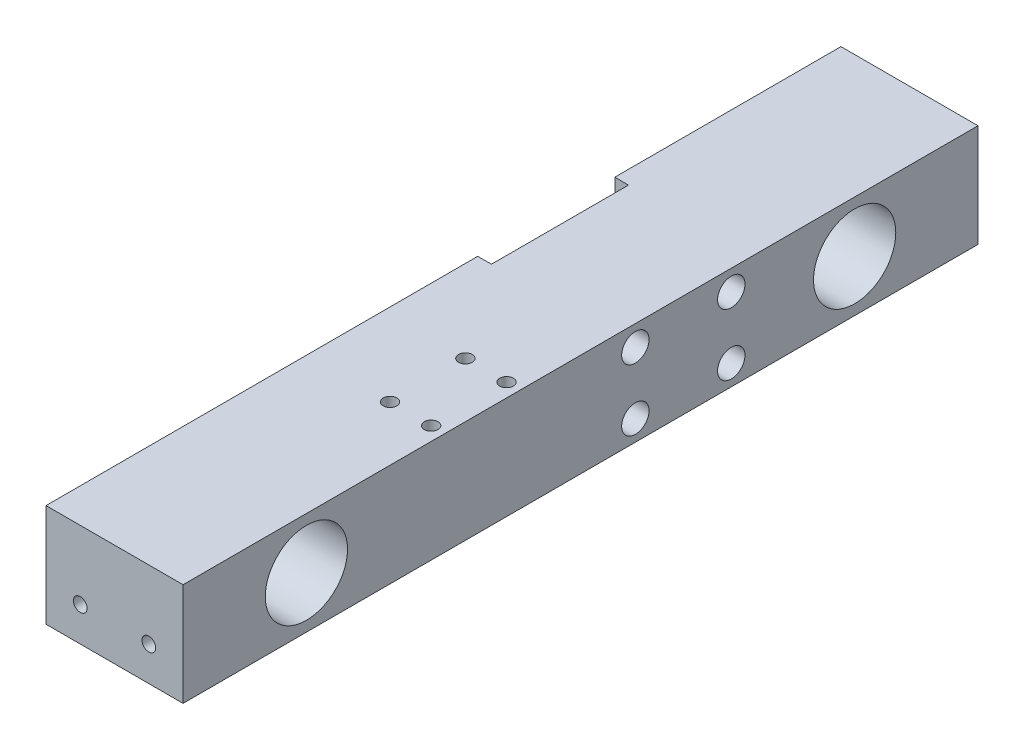
ISO-10303-21;
HEADER;
FILE_DESCRIPTION(('STEP AP214'),'2;1');
FILE_NAME('part.step','',(''),(''),'','','');
FILE_SCHEMA(('AUTOMOTIVE_DESIGN { 1 0 10303 214 1 1 1 1 }'));
ENDSEC;
DATA;
#1=APPLICATION_CONTEXT('core data for automotive mechanical design processes');
#2=APPLICATION_PROTOCOL_DEFINITION('international standard','automotive_design',2000,#1);
#3=PRODUCT_CONTEXT('',#1,'mechanical');
#4=PRODUCT('Part','Part','',(#3));
#5=PRODUCT_RELATED_PRODUCT_CATEGORY('part','',(#4));
#6=PRODUCT_DEFINITION_FORMATION('','',#4);
#7=PRODUCT_DEFINITION_CONTEXT('part definition',#1,'design');
#8=PRODUCT_DEFINITION('design','',#6,#7);
#9=PRODUCT_DEFINITION_SHAPE('','',#8);
#10=(LENGTH_UNIT() NAMED_UNIT(*) SI_UNIT(.MILLI.,.METRE.));
#11=(NAMED_UNIT(*) PLANE_ANGLE_UNIT() SI_UNIT($,.RADIAN.));
#12=(NAMED_UNIT(*) SI_UNIT($,.STERADIAN.) SOLID_ANGLE_UNIT());
#13=UNCERTAINTY_MEASURE_WITH_UNIT(LENGTH_MEASURE(1.E-05),#10,'distance_accuracy_value','');
#14=(GEOMETRIC_REPRESENTATION_CONTEXT(3) GLOBAL_UNCERTAINTY_ASSIGNED_CONTEXT((#13)) GLOBAL_UNIT_ASSIGNED_CONTEXT((#10,
#11,#12)) REPRESENTATION_CONTEXT('',''));
#15=CARTESIAN_POINT('',(0.,0.,0.));
#16=DIRECTION('',(0.,0.,1.));
#17=DIRECTION('',(1.,0.,0.));
#18=AXIS2_PLACEMENT_3D('',#15,#16,#17);
#19=CARTESIAN_POINT('',(20.,12.,36.));
#20=DIRECTION('',(-1.,0.,0.));
#21=DIRECTION('',(0.,-1.,0.));
#22=AXIS2_PLACEMENT_3D('',#19,#20,#21);
#23=CYLINDRICAL_SURFACE('',#22,0.999999999999998);
#24=CARTESIAN_POINT('',(15.,12.,36.));
#25=DIRECTION('',(1.,0.,0.));
#26=DIRECTION('',(0.,0.,-1.));
#27=AXIS2_PLACEMENT_3D('',#24,#25,#26);
#28=CIRCLE('',#27,0.999999999999998);
#29=CARTESIAN_POINT('',(15.,12.,35.));
#30=VERTEX_POINT('',#29);
#31=EDGE_CURVE('E37',#30,#30,#28,.F.);
#32=ORIENTED_EDGE('',*,*,#31,.F.);
#33=EDGE_LOOP('',(#32));
#34=FACE_BOUND('',#33,.T.);
#35=CARTESIAN_POINT('',(2.,12.,36.));
#36=DIRECTION('',(-1.,0.,0.));
#37=DIRECTION('',(0.,-1.,0.));
#38=AXIS2_PLACEMENT_3D('',#35,#36,#37);
#39=CIRCLE('',#38,0.999999999999998);
#40=CARTESIAN_POINT('',(2.,11.,36.));
#41=VERTEX_POINT('',#40);
#42=EDGE_CURVE('E289',#41,#41,#39,.T.);
#43=ORIENTED_EDGE('',*,*,#42,.T.);
#44=EDGE_LOOP('',(#43));
#45=FACE_BOUND('',#44,.T.);
#46=ADVANCED_FACE('F33',(#34,#45),#23,.F.);
#47=CARTESIAN_POINT('',(20.,12.,50.));
#48=DIRECTION('',(-1.,0.,0.));
#49=DIRECTION('',(0.,-1.,0.));
#50=AXIS2_PLACEMENT_3D('',#47,#48,#49);
#51=CYLINDRICAL_SURFACE('',#50,0.999999999999998);
#52=CARTESIAN_POINT('',(15.,12.,50.));
#53=DIRECTION('',(1.,0.,0.));
#54=DIRECTION('',(0.,0.,-1.));
#55=AXIS2_PLACEMENT_3D('',#52,#53,#54);
#56=CIRCLE('',#55,0.999999999999998);
#57=CARTESIAN_POINT('',(15.,12.,49.));
#58=VERTEX_POINT('',#57);
#59=EDGE_CURVE('E274',#58,#58,#56,.T.);
#60=ORIENTED_EDGE('',*,*,#59,.T.);
#61=EDGE_LOOP('',(#60));
#62=FACE_BOUND('',#61,.T.);
#63=CARTESIAN_POINT('',(2.,12.,50.));
#64=DIRECTION('',(-1.,0.,0.));
#65=DIRECTION('',(0.,-1.,0.));
#66=AXIS2_PLACEMENT_3D('',#63,#64,#65);
#67=CIRCLE('',#66,0.999999999999998);
#68=CARTESIAN_POINT('',(2.,11.,50.));
#69=VERTEX_POINT('',#68);
#70=EDGE_CURVE('E290',#69,#69,#67,.F.);
#71=ORIENTED_EDGE('',*,*,#70,.F.);
#72=EDGE_LOOP('',(#71));
#73=FACE_BOUND('',#72,.T.);
#74=ADVANCED_FACE('F285',(#62,#73),#51,.F.);
#75=CARTESIAN_POINT('',(20.,3.,50.));
#76=DIRECTION('',(-1.,0.,0.));
#77=DIRECTION('',(0.,-1.,0.));
#78=AXIS2_PLACEMENT_3D('',#75,#76,#77);
#79=CYLINDRICAL_SURFACE('',#78,0.999999999999998);
#80=CARTESIAN_POINT('',(15.,3.,50.));
#81=DIRECTION('',(1.,0.,0.));
#82=DIRECTION('',(0.,0.,-1.));
#83=AXIS2_PLACEMENT_3D('',#80,#81,#82);
#84=CIRCLE('',#83,0.999999999999998);
#85=CARTESIAN_POINT('',(15.,3.,49.));
#86=VERTEX_POINT('',#85);
#87=EDGE_CURVE('E272',#86,#86,#84,.F.);
#88=ORIENTED_EDGE('',*,*,#87,.F.);
#89=EDGE_LOOP('',(#88));
#90=FACE_BOUND('',#89,.T.);
#91=CARTESIAN_POINT('',(2.,3.,50.));
#92=DIRECTION('',(-1.,0.,0.));
#93=DIRECTION('',(0.,-1.,0.));
#94=AXIS2_PLACEMENT_3D('',#91,#92,#93);
#95=CIRCLE('',#94,0.999999999999998);
#96=CARTESIAN_POINT('',(2.,2.,50.));
#97=VERTEX_POINT('',#96);
#98=EDGE_CURVE('E125',#97,#97,#95,.T.);
#99=ORIENTED_EDGE('',*,*,#98,.T.);
#100=EDGE_LOOP('',(#99));
#101=FACE_BOUND('',#100,.T.);
#102=ADVANCED_FACE('F642',(#90,#101),#79,.F.);
#103=CARTESIAN_POINT('',(20.,3.,36.));
#104=DIRECTION('',(-1.,0.,0.));
#105=DIRECTION('',(0.,-1.,0.));
#106=AXIS2_PLACEMENT_3D('',#103,#104,#105);
#107=CYLINDRICAL_SURFACE('',#106,0.999999999999998);
#108=CARTESIAN_POINT('',(15.,3.,36.));
#109=DIRECTION('',(1.,0.,0.));
#110=DIRECTION('',(0.,0.,-1.));
#111=AXIS2_PLACEMENT_3D('',#108,#109,#110);
#112=CIRCLE('',#111,0.999999999999998);
#113=CARTESIAN_POINT('',(15.,3.,35.));
#114=VERTEX_POINT('',#113);
#115=EDGE_CURVE('E157',#114,#114,#112,.T.);
#116=ORIENTED_EDGE('',*,*,#115,.T.);
#117=EDGE_LOOP('',(#116));
#118=FACE_BOUND('',#117,.T.);
#119=CARTESIAN_POINT('',(2.,3.,36.));
#120=DIRECTION('',(-1.,0.,0.));
#121=DIRECTION('',(0.,-1.,0.));
#122=AXIS2_PLACEMENT_3D('',#119,#120,#121);
#123=CIRCLE('',#122,0.999999999999998);
#124=CARTESIAN_POINT('',(2.,2.,36.));
#125=VERTEX_POINT('',#124);
#126=EDGE_CURVE('E130',#125,#125,#123,.F.);
#127=ORIENTED_EDGE('',*,*,#126,.F.);
#128=EDGE_LOOP('',(#127));
#129=FACE_BOUND('',#128,.T.);
#130=ADVANCED_FACE('F651',(#118,#129),#107,.F.);
#131=CARTESIAN_POINT('',(0.,0.,116.));
#132=DIRECTION('',(-1.,0.,0.));
#133=DIRECTION('',(0.,-1.,0.));
#134=AXIS2_PLACEMENT_3D('',#131,#132,#133);
#135=PLANE('',#134);
#136=CARTESIAN_POINT('',(0.,7.50000000000002,18.));
#137=DIRECTION('',(1.,0.,0.));
#138=DIRECTION('',(0.,0.,-1.));
#139=AXIS2_PLACEMENT_3D('',#136,#137,#138);
#140=CIRCLE('',#139,6.);
#141=CARTESIAN_POINT('',(0.,7.50000000000002,12.));
#142=VERTEX_POINT('',#141);
#143=EDGE_CURVE('E206',#142,#142,#140,.F.);
#144=ORIENTED_EDGE('',*,*,#143,.F.);
#145=EDGE_LOOP('',(#144));
#146=FACE_BOUND('',#145,.T.);
#147=DIRECTION('',(0.,0.,-1.));
#148=VECTOR('',#147,1.);
#149=CARTESIAN_POINT('',(0.,0.,116.));
#150=LINE('',#149,#148);
#151=CARTESIAN_POINT('',(0.,0.,33.));
#152=VERTEX_POINT('',#151);
#153=CARTESIAN_POINT('',(0.,0.,0.));
#154=VERTEX_POINT('',#153);
#155=EDGE_CURVE('E42',#152,#154,#150,.T.);
#156=ORIENTED_EDGE('',*,*,#155,.F.);
#157=DIRECTION('',(0.,1.,0.));
#158=VECTOR('',#157,1.);
#159=CARTESIAN_POINT('',(0.,0.,33.));
#160=LINE('',#159,#158);
#161=CARTESIAN_POINT('',(0.,15.,33.));
#162=VERTEX_POINT('',#161);
#163=EDGE_CURVE('E122',#152,#162,#160,.T.);
#164=ORIENTED_EDGE('',*,*,#163,.T.);
#165=DIRECTION('',(0.,0.,-1.));
#166=VECTOR('',#165,1.);
#167=CARTESIAN_POINT('',(0.,15.,116.));
#168=LINE('',#167,#166);
#169=CARTESIAN_POINT('',(0.,15.,0.));
#170=VERTEX_POINT('',#169);
#171=EDGE_CURVE('E244',#162,#170,#168,.T.);
#172=ORIENTED_EDGE('',*,*,#171,.T.);
#173=DIRECTION('',(0.,1.,0.));
#174=VECTOR('',#173,1.);
#175=CARTESIAN_POINT('',(0.,0.,0.));
#176=LINE('',#175,#174);
#177=EDGE_CURVE('E226',#154,#170,#176,.T.);
#178=ORIENTED_EDGE('',*,*,#177,.F.);
#179=EDGE_LOOP('',(#156,#164,#172,#178));
#180=FACE_BOUND('',#179,.T.);
#181=ADVANCED_FACE('F308',(#146,#180),#135,.T.);
#182=CARTESIAN_POINT('',(0.,0.,116.));
#183=DIRECTION('',(0.,1.,0.));
#184=DIRECTION('',(0.,0.,1.));
#185=AXIS2_PLACEMENT_3D('',#182,#183,#184);
#186=PLANE('',#185);
#187=CARTESIAN_POINT('',(18.,0.,66.8));
#188=DIRECTION('',(0.,-1.,0.));
#189=DIRECTION('',(0.,0.,-1.));
#190=AXIS2_PLACEMENT_3D('',#187,#188,#189);
#191=CIRCLE('',#190,1.5);
#192=CARTESIAN_POINT('',(18.,0.,65.3));
#193=VERTEX_POINT('',#192);
#194=EDGE_CURVE('E170',#193,#193,#191,.T.);
#195=ORIENTED_EDGE('',*,*,#194,.F.);
#196=EDGE_LOOP('',(#195));
#197=FACE_BOUND('',#196,.T.);
#198=CARTESIAN_POINT('',(12.,0.,77.8));
#199=DIRECTION('',(0.,-1.,0.));
#200=DIRECTION('',(0.,0.,-1.));
#201=AXIS2_PLACEMENT_3D('',#198,#199,#200);
#202=CIRCLE('',#201,1.5);
#203=CARTESIAN_POINT('',(12.,0.,76.3));
#204=VERTEX_POINT('',#203);
#205=EDGE_CURVE('E160',#204,#204,#202,.T.);
#206=ORIENTED_EDGE('',*,*,#205,.F.);
#207=EDGE_LOOP('',(#206));
#208=FACE_BOUND('',#207,.T.);
#209=CARTESIAN_POINT('',(18.,0.,77.8));
#210=DIRECTION('',(0.,-1.,0.));
#211=DIRECTION('',(0.,0.,-1.));
#212=AXIS2_PLACEMENT_3D('',#209,#210,#211);
#213=CIRCLE('',#212,1.5);
#214=CARTESIAN_POINT('',(18.,0.,76.3));
#215=VERTEX_POINT('',#214);
#216=EDGE_CURVE('E174',#215,#215,#213,.T.);
#217=ORIENTED_EDGE('',*,*,#216,.F.);
#218=EDGE_LOOP('',(#217));
#219=FACE_BOUND('',#218,.T.);
#220=CARTESIAN_POINT('',(12.,0.,66.8));
#221=DIRECTION('',(0.,-1.,0.));
#222=DIRECTION('',(0.,0.,-1.));
#223=AXIS2_PLACEMENT_3D('',#220,#221,#222);
#224=CIRCLE('',#223,1.5);
#225=CARTESIAN_POINT('',(12.,0.,65.3));
#226=VERTEX_POINT('',#225);
#227=EDGE_CURVE('E167',#226,#226,#224,.T.);
#228=ORIENTED_EDGE('',*,*,#227,.F.);
#229=EDGE_LOOP('',(#228));
#230=FACE_BOUND('',#229,.T.);
#231=DIRECTION('',(-1.,0.,0.));
#232=VECTOR('',#231,1.);
#233=CARTESIAN_POINT('',(2.,0.,33.));
#234=LINE('',#233,#232);
#235=CARTESIAN_POINT('',(2.,0.,33.));
#236=VERTEX_POINT('',#235);
#237=EDGE_CURVE('E153',#236,#152,#234,.T.);
#238=ORIENTED_EDGE('',*,*,#237,.T.);
#239=ORIENTED_EDGE('',*,*,#155,.T.);
#240=DIRECTION('',(1.,0.,0.));
#241=VECTOR('',#240,1.);
#242=CARTESIAN_POINT('',(0.,0.,0.));
#243=LINE('',#242,#241);
#244=CARTESIAN_POINT('',(20.,0.,0.));
#245=VERTEX_POINT('',#244);
#246=EDGE_CURVE('E238',#154,#245,#243,.T.);
#247=ORIENTED_EDGE('',*,*,#246,.T.);
#248=DIRECTION('',(0.,0.,-1.));
#249=VECTOR('',#248,1.);
#250=CARTESIAN_POINT('',(20.,0.,116.));
#251=LINE('',#250,#249);
#252=CARTESIAN_POINT('',(20.,0.,116.));
#253=VERTEX_POINT('',#252);
#254=EDGE_CURVE('E254',#253,#245,#251,.T.);
#255=ORIENTED_EDGE('',*,*,#254,.F.);
#256=DIRECTION('',(1.,0.,0.));
#257=VECTOR('',#256,1.);
#258=CARTESIAN_POINT('',(0.,0.,116.));
#259=LINE('',#258,#257);
#260=CARTESIAN_POINT('',(0.,0.,116.));
#261=VERTEX_POINT('',#260);
#262=EDGE_CURVE('E242',#261,#253,#259,.T.);
#263=ORIENTED_EDGE('',*,*,#262,.F.);
#264=CARTESIAN_POINT('',(0.,0.,53.));
#265=VERTEX_POINT('',#264);
#266=EDGE_CURVE('E11',#261,#265,#150,.T.);
#267=ORIENTED_EDGE('',*,*,#266,.T.);
#268=DIRECTION('',(-1.,0.,0.));
#269=VECTOR('',#268,1.);
#270=CARTESIAN_POINT('',(2.,0.,53.));
#271=LINE('',#270,#269);
#272=CARTESIAN_POINT('',(2.,0.,53.));
#273=VERTEX_POINT('',#272);
#274=EDGE_CURVE('E111',#273,#265,#271,.T.);
#275=ORIENTED_EDGE('',*,*,#274,.F.);
#276=DIRECTION('',(0.,0.,1.));
#277=VECTOR('',#276,1.);
#278=CARTESIAN_POINT('',(2.,0.,0.));
#279=LINE('',#278,#277);
#280=EDGE_CURVE('E115',#236,#273,#279,.T.);
#281=ORIENTED_EDGE('',*,*,#280,.F.);
#282=EDGE_LOOP('',(#238,#239,#247,#255,#263,#267,#275,#281));
#283=FACE_BOUND('',#282,.T.);
#284=ADVANCED_FACE('F124',(#197,#208,#219,#230,#283),#186,.F.);
#285=CARTESIAN_POINT('',(0.,15.,116.));
#286=DIRECTION('',(0.,1.,0.));
#287=DIRECTION('',(-1.,0.,0.));
#288=AXIS2_PLACEMENT_3D('',#285,#286,#287);
#289=PLANE('',#288);
#290=CARTESIAN_POINT('',(12.,15.,77.8));
#291=DIRECTION('',(0.,-1.,0.));
#292=DIRECTION('',(1.,0.,0.));
#293=AXIS2_PLACEMENT_3D('',#290,#291,#292);
#294=CIRCLE('',#293,1.);
#295=CARTESIAN_POINT('',(13.,15.,77.8));
#296=VERTEX_POINT('',#295);
#297=EDGE_CURVE('E185',#296,#296,#294,.T.);
#298=ORIENTED_EDGE('',*,*,#297,.T.);
#299=EDGE_LOOP('',(#298));
#300=FACE_BOUND('',#299,.T.);
#301=CARTESIAN_POINT('',(12.,15.,66.8));
#302=DIRECTION('',(0.,1.,0.));
#303=DIRECTION('',(-1.,0.,0.));
#304=AXIS2_PLACEMENT_3D('',#301,#302,#303);
#305=CIRCLE('',#304,1.);
#306=CARTESIAN_POINT('',(11.,15.,66.8));
#307=VERTEX_POINT('',#306);
#308=EDGE_CURVE('E188',#307,#307,#305,.T.);
#309=ORIENTED_EDGE('',*,*,#308,.F.);
#310=EDGE_LOOP('',(#309));
#311=FACE_BOUND('',#310,.T.);
#312=CARTESIAN_POINT('',(18.,15.,77.8));
#313=DIRECTION('',(0.,1.,0.));
#314=DIRECTION('',(-1.,0.,0.));
#315=AXIS2_PLACEMENT_3D('',#312,#313,#314);
#316=CIRCLE('',#315,1.);
#317=CARTESIAN_POINT('',(17.,15.,77.8));
#318=VERTEX_POINT('',#317);
#319=EDGE_CURVE('E189',#318,#318,#316,.T.);
#320=ORIENTED_EDGE('',*,*,#319,.F.);
#321=EDGE_LOOP('',(#320));
#322=FACE_BOUND('',#321,.T.);
#323=CARTESIAN_POINT('',(18.,15.,66.8));
#324=DIRECTION('',(0.,-1.,0.));
#325=DIRECTION('',(1.,0.,0.));
#326=AXIS2_PLACEMENT_3D('',#323,#324,#325);
#327=CIRCLE('',#326,1.);
#328=CARTESIAN_POINT('',(19.,15.,66.8));
#329=VERTEX_POINT('',#328);
#330=EDGE_CURVE('E192',#329,#329,#327,.T.);
#331=ORIENTED_EDGE('',*,*,#330,.T.);
#332=EDGE_LOOP('',(#331));
#333=FACE_BOUND('',#332,.T.);
#334=ORIENTED_EDGE('',*,*,#171,.F.);
#335=DIRECTION('',(-1.,0.,0.));
#336=VECTOR('',#335,1.);
#337=CARTESIAN_POINT('',(2.,15.,33.));
#338=LINE('',#337,#336);
#339=CARTESIAN_POINT('',(2.,15.,33.));
#340=VERTEX_POINT('',#339);
#341=EDGE_CURVE('E127',#340,#162,#338,.T.);
#342=ORIENTED_EDGE('',*,*,#341,.F.);
#343=DIRECTION('',(0.,0.,1.));
#344=VECTOR('',#343,1.);
#345=CARTESIAN_POINT('',(2.,15.,0.));
#346=LINE('',#345,#344);
#347=CARTESIAN_POINT('',(2.,15.,53.));
#348=VERTEX_POINT('',#347);
#349=EDGE_CURVE('E114',#340,#348,#346,.T.);
#350=ORIENTED_EDGE('',*,*,#349,.T.);
#351=DIRECTION('',(-1.,0.,0.));
#352=VECTOR('',#351,1.);
#353=CARTESIAN_POINT('',(2.,15.,53.));
#354=LINE('',#353,#352);
#355=CARTESIAN_POINT('',(0.,15.,53.));
#356=VERTEX_POINT('',#355);
#357=EDGE_CURVE('E112',#348,#356,#354,.T.);
#358=ORIENTED_EDGE('',*,*,#357,.T.);
#359=CARTESIAN_POINT('',(0.,15.,116.));
#360=VERTEX_POINT('',#359);
#361=EDGE_CURVE('E86',#360,#356,#168,.T.);
#362=ORIENTED_EDGE('',*,*,#361,.F.);
#363=DIRECTION('',(1.,0.,0.));
#364=VECTOR('',#363,1.);
#365=CARTESIAN_POINT('',(0.,15.,116.));
#366=LINE('',#365,#364);
#367=CARTESIAN_POINT('',(20.,15.,116.));
#368=VERTEX_POINT('',#367);
#369=EDGE_CURVE('E237',#360,#368,#366,.T.);
#370=ORIENTED_EDGE('',*,*,#369,.T.);
#371=DIRECTION('',(0.,0.,-1.));
#372=VECTOR('',#371,1.);
#373=CARTESIAN_POINT('',(20.,15.,116.));
#374=LINE('',#373,#372);
#375=CARTESIAN_POINT('',(20.,15.,0.));
#376=VERTEX_POINT('',#375);
#377=EDGE_CURVE('E257',#368,#376,#374,.T.);
#378=ORIENTED_EDGE('',*,*,#377,.T.);
#379=DIRECTION('',(1.,0.,0.));
#380=VECTOR('',#379,1.);
#381=CARTESIAN_POINT('',(0.,15.,0.));
#382=LINE('',#381,#380);
#383=EDGE_CURVE('E247',#170,#376,#382,.T.);
#384=ORIENTED_EDGE('',*,*,#383,.F.);
#385=EDGE_LOOP('',(#334,#342,#350,#358,#362,#370,#378,#384));
#386=FACE_BOUND('',#385,.T.);
#387=ADVANCED_FACE('F311',(#300,#311,#322,#333,#386),#289,.T.);
#388=DIRECTION('',(0.,1.,0.));
#389=VECTOR('',#388,1.);
#390=CARTESIAN_POINT('',(0.,0.,53.));
#391=LINE('',#390,#389);
#392=EDGE_CURVE('E299',#265,#356,#391,.T.);
#393=ORIENTED_EDGE('',*,*,#392,.F.);
#394=ORIENTED_EDGE('',*,*,#266,.F.);
#395=DIRECTION('',(0.,1.,0.));
#396=VECTOR('',#395,1.);
#397=CARTESIAN_POINT('',(0.,0.,116.));
#398=LINE('',#397,#396);
#399=EDGE_CURVE('E235',#261,#360,#398,.T.);
#400=ORIENTED_EDGE('',*,*,#399,.T.);
#401=ORIENTED_EDGE('',*,*,#361,.T.);
#402=EDGE_LOOP('',(#393,#394,#400,#401));
#403=FACE_BOUND('',#402,.T.);
#404=CARTESIAN_POINT('',(0.,7.50000000000001,98.));
#405=DIRECTION('',(1.,0.,0.));
#406=DIRECTION('',(0.,0.,-1.));
#407=AXIS2_PLACEMENT_3D('',#404,#405,#406);
#408=CIRCLE('',#407,6.);
#409=CARTESIAN_POINT('',(0.,7.50000000000001,92.));
#410=VERTEX_POINT('',#409);
#411=EDGE_CURVE('E199',#410,#410,#408,.T.);
#412=ORIENTED_EDGE('',*,*,#411,.T.);
#413=EDGE_LOOP('',(#412));
#414=FACE_BOUND('',#413,.T.);
#415=ADVANCED_FACE('F35',(#403,#414),#135,.T.);
#416=CARTESIAN_POINT('',(20.,0.,116.));
#417=DIRECTION('',(-1.,0.,0.));
#418=DIRECTION('',(0.,0.,1.));
#419=AXIS2_PLACEMENT_3D('',#416,#417,#418);
#420=PLANE('',#419);
#421=CARTESIAN_POINT('',(20.,12.,50.));
#422=DIRECTION('',(1.,0.,0.));
#423=DIRECTION('',(0.,0.,-1.));
#424=AXIS2_PLACEMENT_3D('',#421,#422,#423);
#425=CIRCLE('',#424,2.);
#426=CARTESIAN_POINT('',(20.,12.,48.));
#427=VERTEX_POINT('',#426);
#428=EDGE_CURVE('E150',#427,#427,#425,.T.);
#429=ORIENTED_EDGE('',*,*,#428,.F.);
#430=EDGE_LOOP('',(#429));
#431=FACE_BOUND('',#430,.T.);
#432=CARTESIAN_POINT('',(20.,3.,50.));
#433=DIRECTION('',(1.,0.,0.));
#434=DIRECTION('',(0.,0.,-1.));
#435=AXIS2_PLACEMENT_3D('',#432,#433,#434);
#436=CIRCLE('',#435,2.);
#437=CARTESIAN_POINT('',(20.,3.,48.));
#438=VERTEX_POINT('',#437);
#439=EDGE_CURVE('E144',#438,#438,#436,.T.);
#440=ORIENTED_EDGE('',*,*,#439,.F.);
#441=EDGE_LOOP('',(#440));
#442=FACE_BOUND('',#441,.T.);
#443=CARTESIAN_POINT('',(20.,3.,36.));
#444=DIRECTION('',(1.,0.,0.));
#445=DIRECTION('',(0.,0.,-1.));
#446=AXIS2_PLACEMENT_3D('',#443,#444,#445);
#447=CIRCLE('',#446,2.);
#448=CARTESIAN_POINT('',(20.,3.,34.));
#449=VERTEX_POINT('',#448);
#450=EDGE_CURVE('E138',#449,#449,#447,.T.);
#451=ORIENTED_EDGE('',*,*,#450,.F.);
#452=EDGE_LOOP('',(#451));
#453=FACE_BOUND('',#452,.T.);
#454=CARTESIAN_POINT('',(20.,12.,36.));
#455=DIRECTION('',(1.,0.,0.));
#456=DIRECTION('',(0.,0.,-1.));
#457=AXIS2_PLACEMENT_3D('',#454,#455,#456);
#458=CIRCLE('',#457,2.);
#459=CARTESIAN_POINT('',(20.,12.,34.));
#460=VERTEX_POINT('',#459);
#461=EDGE_CURVE('E137',#460,#460,#458,.T.);
#462=ORIENTED_EDGE('',*,*,#461,.F.);
#463=EDGE_LOOP('',(#462));
#464=FACE_BOUND('',#463,.T.);
#465=DIRECTION('',(0.,1.,0.));
#466=VECTOR('',#465,1.);
#467=CARTESIAN_POINT('',(20.,0.,0.));
#468=LINE('',#467,#466);
#469=EDGE_CURVE('E250',#245,#376,#468,.T.);
#470=ORIENTED_EDGE('',*,*,#469,.T.);
#471=ORIENTED_EDGE('',*,*,#377,.F.);
#472=DIRECTION('',(0.,1.,0.));
#473=VECTOR('',#472,1.);
#474=CARTESIAN_POINT('',(20.,0.,116.));
#475=LINE('',#474,#473);
#476=EDGE_CURVE('E240',#253,#368,#475,.T.);
#477=ORIENTED_EDGE('',*,*,#476,.F.);
#478=ORIENTED_EDGE('',*,*,#254,.T.);
#479=EDGE_LOOP('',(#470,#471,#477,#478));
#480=FACE_BOUND('',#479,.T.);
#481=CARTESIAN_POINT('',(20.,7.50000000000002,18.));
#482=DIRECTION('',(1.,0.,0.));
#483=DIRECTION('',(0.,0.,-1.));
#484=AXIS2_PLACEMENT_3D('',#481,#482,#483);
#485=CIRCLE('',#484,6.);
#486=CARTESIAN_POINT('',(20.,7.50000000000002,12.));
#487=VERTEX_POINT('',#486);
#488=EDGE_CURVE('E198',#487,#487,#485,.F.);
#489=ORIENTED_EDGE('',*,*,#488,.T.);
#490=EDGE_LOOP('',(#489));
#491=FACE_BOUND('',#490,.T.);
#492=CARTESIAN_POINT('',(20.,7.50000000000001,98.));
#493=DIRECTION('',(1.,0.,0.));
#494=DIRECTION('',(0.,0.,-1.));
#495=AXIS2_PLACEMENT_3D('',#492,#493,#494);
#496=CIRCLE('',#495,6.);
#497=CARTESIAN_POINT('',(20.,7.50000000000001,92.));
#498=VERTEX_POINT('',#497);
#499=EDGE_CURVE('E203',#498,#498,#496,.T.);
#500=ORIENTED_EDGE('',*,*,#499,.F.);
#501=EDGE_LOOP('',(#500));
#502=FACE_BOUND('',#501,.T.);
#503=ADVANCED_FACE('F320',(#431,#442,#453,#464,#480,#491,#502),#420,.F.);
#504=CARTESIAN_POINT('',(12.,0.,66.8));
#505=DIRECTION('',(0.,1.,0.));
#506=DIRECTION('',(-1.,0.,0.));
#507=AXIS2_PLACEMENT_3D('',#504,#505,#506);
#508=CYLINDRICAL_SURFACE('',#507,1.);
#509=ORIENTED_EDGE('',*,*,#308,.T.);
#510=EDGE_LOOP('',(#509));
#511=FACE_BOUND('',#510,.T.);
#512=CARTESIAN_POINT('',(12.,5.,66.8));
#513=DIRECTION('',(0.,-1.,0.));
#514=DIRECTION('',(0.,0.,-1.));
#515=AXIS2_PLACEMENT_3D('',#512,#513,#514);
#516=CIRCLE('',#515,1.);
#517=CARTESIAN_POINT('',(12.,5.,65.8));
#518=VERTEX_POINT('',#517);
#519=EDGE_CURVE('E195',#518,#518,#516,.F.);
#520=ORIENTED_EDGE('',*,*,#519,.F.);
#521=EDGE_LOOP('',(#520));
#522=FACE_BOUND('',#521,.T.);
#523=ADVANCED_FACE('F339',(#511,#522),#508,.F.);
#524=CARTESIAN_POINT('',(12.,0.,77.8));
#525=DIRECTION('',(0.,1.,0.));
#526=DIRECTION('',(-1.,0.,0.));
#527=AXIS2_PLACEMENT_3D('',#524,#525,#526);
#528=CYLINDRICAL_SURFACE('',#527,1.);
#529=ORIENTED_EDGE('',*,*,#297,.F.);
#530=EDGE_LOOP('',(#529));
#531=FACE_BOUND('',#530,.T.);
#532=CARTESIAN_POINT('',(12.,5.,77.8));
#533=DIRECTION('',(0.,-1.,0.));
#534=DIRECTION('',(0.,0.,-1.));
#535=AXIS2_PLACEMENT_3D('',#532,#533,#534);
#536=CIRCLE('',#535,1.);
#537=CARTESIAN_POINT('',(12.,5.,76.8));
#538=VERTEX_POINT('',#537);
#539=EDGE_CURVE('E265',#538,#538,#536,.T.);
#540=ORIENTED_EDGE('',*,*,#539,.T.);
#541=EDGE_LOOP('',(#540));
#542=FACE_BOUND('',#541,.T.);
#543=ADVANCED_FACE('F345',(#531,#542),#528,.F.);
#544=CARTESIAN_POINT('',(18.,0.,77.8));
#545=DIRECTION('',(0.,1.,0.));
#546=DIRECTION('',(-1.,0.,0.));
#547=AXIS2_PLACEMENT_3D('',#544,#545,#546);
#548=CYLINDRICAL_SURFACE('',#547,1.);
#549=ORIENTED_EDGE('',*,*,#319,.T.);
#550=EDGE_LOOP('',(#549));
#551=FACE_BOUND('',#550,.T.);
#552=CARTESIAN_POINT('',(18.,5.,77.8));
#553=DIRECTION('',(0.,-1.,0.));
#554=DIRECTION('',(0.,0.,-1.));
#555=AXIS2_PLACEMENT_3D('',#552,#553,#554);
#556=CIRCLE('',#555,1.);
#557=CARTESIAN_POINT('',(18.,5.,76.8));
#558=VERTEX_POINT('',#557);
#559=EDGE_CURVE('E262',#558,#558,#556,.F.);
#560=ORIENTED_EDGE('',*,*,#559,.F.);
#561=EDGE_LOOP('',(#560));
#562=FACE_BOUND('',#561,.T.);
#563=ADVANCED_FACE('F369',(#551,#562),#548,.F.);
#564=CARTESIAN_POINT('',(18.,0.,66.8));
#565=DIRECTION('',(0.,1.,0.));
#566=DIRECTION('',(-1.,0.,0.));
#567=AXIS2_PLACEMENT_3D('',#564,#565,#566);
#568=CYLINDRICAL_SURFACE('',#567,1.);
#569=ORIENTED_EDGE('',*,*,#330,.F.);
#570=EDGE_LOOP('',(#569));
#571=FACE_BOUND('',#570,.T.);
#572=CARTESIAN_POINT('',(18.,5.,66.8));
#573=DIRECTION('',(0.,-1.,0.));
#574=DIRECTION('',(0.,0.,-1.));
#575=AXIS2_PLACEMENT_3D('',#572,#573,#574);
#576=CIRCLE('',#575,1.);
#577=CARTESIAN_POINT('',(18.,5.,65.8));
#578=VERTEX_POINT('',#577);
#579=EDGE_CURVE('E182',#578,#578,#576,.T.);
#580=ORIENTED_EDGE('',*,*,#579,.T.);
#581=EDGE_LOOP('',(#580));
#582=FACE_BOUND('',#581,.T.);
#583=ADVANCED_FACE('F366',(#571,#582),#568,.F.);
#584=CARTESIAN_POINT('',(0.,0.,116.));
#585=DIRECTION('',(0.,0.,-1.));
#586=DIRECTION('',(-1.,0.,0.));
#587=AXIS2_PLACEMENT_3D('',#584,#585,#586);
#588=PLANE('',#587);
#589=CARTESIAN_POINT('',(5.,5.00000000000001,116.));
#590=DIRECTION('',(0.,0.,1.));
#591=DIRECTION('',(1.,0.,0.));
#592=AXIS2_PLACEMENT_3D('',#589,#590,#591);
#593=CIRCLE('',#592,1.);
#594=CARTESIAN_POINT('',(6.,5.00000000000001,116.));
#595=VERTEX_POINT('',#594);
#596=EDGE_CURVE('E218',#595,#595,#593,.T.);
#597=ORIENTED_EDGE('',*,*,#596,.F.);
#598=EDGE_LOOP('',(#597));
#599=FACE_BOUND('',#598,.T.);
#600=ORIENTED_EDGE('',*,*,#399,.F.);
#601=ORIENTED_EDGE('',*,*,#262,.T.);
#602=ORIENTED_EDGE('',*,*,#476,.T.);
#603=ORIENTED_EDGE('',*,*,#369,.F.);
#604=EDGE_LOOP('',(#600,#601,#602,#603));
#605=FACE_BOUND('',#604,.T.);
#606=CARTESIAN_POINT('',(15.,5.00000000000001,116.));
#607=DIRECTION('',(0.,0.,-1.));
#608=DIRECTION('',(-1.,0.,0.));
#609=AXIS2_PLACEMENT_3D('',#606,#607,#608);
#610=CIRCLE('',#609,1.);
#611=CARTESIAN_POINT('',(14.,5.00000000000001,116.));
#612=VERTEX_POINT('',#611);
#613=EDGE_CURVE('E215',#612,#612,#610,.T.);
#614=ORIENTED_EDGE('',*,*,#613,.T.);
#615=EDGE_LOOP('',(#614));
#616=FACE_BOUND('',#615,.T.);
#617=ADVANCED_FACE('F324',(#599,#605,#616),#588,.F.);
#618=CARTESIAN_POINT('',(0.,0.,0.));
#619=DIRECTION('',(0.,0.,-1.));
#620=DIRECTION('',(-1.,0.,0.));
#621=AXIS2_PLACEMENT_3D('',#618,#619,#620);
#622=PLANE('',#621);
#623=ORIENTED_EDGE('',*,*,#177,.T.);
#624=ORIENTED_EDGE('',*,*,#383,.T.);
#625=ORIENTED_EDGE('',*,*,#469,.F.);
#626=ORIENTED_EDGE('',*,*,#246,.F.);
#627=EDGE_LOOP('',(#623,#624,#625,#626));
#628=FACE_BOUND('',#627,.T.);
#629=CARTESIAN_POINT('',(5.,5.00000000000001,0.));
#630=DIRECTION('',(0.,0.,-1.));
#631=DIRECTION('',(-1.,0.,0.));
#632=AXIS2_PLACEMENT_3D('',#629,#630,#631);
#633=CIRCLE('',#632,1.);
#634=CARTESIAN_POINT('',(4.,5.00000000000001,0.));
#635=VERTEX_POINT('',#634);
#636=EDGE_CURVE('E230',#635,#635,#633,.T.);
#637=ORIENTED_EDGE('',*,*,#636,.F.);
#638=EDGE_LOOP('',(#637));
#639=FACE_BOUND('',#638,.T.);
#640=CARTESIAN_POINT('',(15.,5.00000000000001,0.));
#641=DIRECTION('',(0.,0.,1.));
#642=DIRECTION('',(1.,0.,0.));
#643=AXIS2_PLACEMENT_3D('',#640,#641,#642);
#644=CIRCLE('',#643,1.);
#645=CARTESIAN_POINT('',(16.,5.00000000000001,0.));
#646=VERTEX_POINT('',#645);
#647=EDGE_CURVE('E227',#646,#646,#644,.T.);
#648=ORIENTED_EDGE('',*,*,#647,.T.);
#649=EDGE_LOOP('',(#648));
#650=FACE_BOUND('',#649,.T.);
#651=ADVANCED_FACE('F315',(#628,#639,#650),#622,.T.);
#652=CARTESIAN_POINT('',(5.,5.00000000000001,10.));
#653=DIRECTION('',(0.,0.,-1.));
#654=DIRECTION('',(-1.,0.,0.));
#655=AXIS2_PLACEMENT_3D('',#652,#653,#654);
#656=CYLINDRICAL_SURFACE('',#655,1.);
#657=CARTESIAN_POINT('',(5.,5.00000000000001,10.));
#658=DIRECTION('',(0.,0.,-1.));
#659=DIRECTION('',(-1.,0.,0.));
#660=AXIS2_PLACEMENT_3D('',#657,#658,#659);
#661=CIRCLE('',#660,1.);
#662=CARTESIAN_POINT('',(4.,5.00000000000001,10.));
#663=VERTEX_POINT('',#662);
#664=EDGE_CURVE('E214',#663,#663,#661,.T.);
#665=ORIENTED_EDGE('',*,*,#664,.F.);
#666=EDGE_LOOP('',(#665));
#667=FACE_BOUND('',#666,.T.);
#668=ORIENTED_EDGE('',*,*,#636,.T.);
#669=EDGE_LOOP('',(#668));
#670=FACE_BOUND('',#669,.T.);
#671=ADVANCED_FACE('F453',(#667,#670),#656,.F.);
#672=CARTESIAN_POINT('',(5.,5.00000000000001,10.));
#673=DIRECTION('',(0.,0.,-1.));
#674=DIRECTION('',(-1.,0.,0.));
#675=AXIS2_PLACEMENT_3D('',#672,#673,#674);
#676=PLANE('',#675);
#677=ORIENTED_EDGE('',*,*,#664,.T.);
#678=EDGE_LOOP('',(#677));
#679=FACE_BOUND('',#678,.T.);
#680=ADVANCED_FACE('F451',(#679),#676,.T.);
#681=CARTESIAN_POINT('',(15.,5.00000000000001,10.));
#682=DIRECTION('',(0.,0.,-1.));
#683=DIRECTION('',(-1.,0.,0.));
#684=AXIS2_PLACEMENT_3D('',#681,#682,#683);
#685=CYLINDRICAL_SURFACE('',#684,1.);
#686=CARTESIAN_POINT('',(15.,5.00000000000001,10.));
#687=DIRECTION('',(0.,0.,1.));
#688=DIRECTION('',(1.,0.,0.));
#689=AXIS2_PLACEMENT_3D('',#686,#687,#688);
#690=CIRCLE('',#689,1.);
#691=CARTESIAN_POINT('',(16.,5.00000000000001,10.));
#692=VERTEX_POINT('',#691);
#693=EDGE_CURVE('E223',#692,#692,#690,.T.);
#694=ORIENTED_EDGE('',*,*,#693,.T.);
#695=EDGE_LOOP('',(#694));
#696=FACE_BOUND('',#695,.T.);
#697=ORIENTED_EDGE('',*,*,#647,.F.);
#698=EDGE_LOOP('',(#697));
#699=FACE_BOUND('',#698,.T.);
#700=ADVANCED_FACE('F447',(#696,#699),#685,.F.);
#701=CARTESIAN_POINT('',(15.,5.00000000000001,10.));
#702=DIRECTION('',(0.,0.,1.));
#703=DIRECTION('',(1.,0.,0.));
#704=AXIS2_PLACEMENT_3D('',#701,#702,#703);
#705=PLANE('',#704);
#706=ORIENTED_EDGE('',*,*,#693,.F.);
#707=EDGE_LOOP('',(#706));
#708=FACE_BOUND('',#707,.T.);
#709=ADVANCED_FACE('F440',(#708),#705,.F.);
#710=CARTESIAN_POINT('',(5.,5.00000000000001,106.));
#711=DIRECTION('',(0.,0.,1.));
#712=DIRECTION('',(1.,0.,0.));
#713=AXIS2_PLACEMENT_3D('',#710,#711,#712);
#714=CYLINDRICAL_SURFACE('',#713,1.);
#715=CARTESIAN_POINT('',(5.,5.00000000000001,106.));
#716=DIRECTION('',(0.,0.,1.));
#717=DIRECTION('',(1.,0.,0.));
#718=AXIS2_PLACEMENT_3D('',#715,#716,#717);
#719=CIRCLE('',#718,1.);
#720=CARTESIAN_POINT('',(6.,5.00000000000001,106.));
#721=VERTEX_POINT('',#720);
#722=EDGE_CURVE('E202',#721,#721,#719,.T.);
#723=ORIENTED_EDGE('',*,*,#722,.F.);
#724=EDGE_LOOP('',(#723));
#725=FACE_BOUND('',#724,.T.);
#726=ORIENTED_EDGE('',*,*,#596,.T.);
#727=EDGE_LOOP('',(#726));
#728=FACE_BOUND('',#727,.T.);
#729=ADVANCED_FACE('F437',(#725,#728),#714,.F.);
#730=CARTESIAN_POINT('',(5.,5.00000000000001,106.));
#731=DIRECTION('',(0.,0.,1.));
#732=DIRECTION('',(1.,0.,0.));
#733=AXIS2_PLACEMENT_3D('',#730,#731,#732);
#734=PLANE('',#733);
#735=ORIENTED_EDGE('',*,*,#722,.T.);
#736=EDGE_LOOP('',(#735));
#737=FACE_BOUND('',#736,.T.);
#738=ADVANCED_FACE('F435',(#737),#734,.T.);
#739=CARTESIAN_POINT('',(15.,5.00000000000001,106.));
#740=DIRECTION('',(0.,0.,1.));
#741=DIRECTION('',(1.,0.,0.));
#742=AXIS2_PLACEMENT_3D('',#739,#740,#741);
#743=CYLINDRICAL_SURFACE('',#742,1.);
#744=CARTESIAN_POINT('',(15.,5.00000000000001,106.));
#745=DIRECTION('',(0.,0.,-1.));
#746=DIRECTION('',(-1.,0.,0.));
#747=AXIS2_PLACEMENT_3D('',#744,#745,#746);
#748=CIRCLE('',#747,1.);
#749=CARTESIAN_POINT('',(14.,5.00000000000001,106.));
#750=VERTEX_POINT('',#749);
#751=EDGE_CURVE('E211',#750,#750,#748,.T.);
#752=ORIENTED_EDGE('',*,*,#751,.T.);
#753=EDGE_LOOP('',(#752));
#754=FACE_BOUND('',#753,.T.);
#755=ORIENTED_EDGE('',*,*,#613,.F.);
#756=EDGE_LOOP('',(#755));
#757=FACE_BOUND('',#756,.T.);
#758=ADVANCED_FACE('F431',(#754,#757),#743,.F.);
#759=CARTESIAN_POINT('',(15.,5.00000000000001,106.));
#760=DIRECTION('',(0.,0.,-1.));
#761=DIRECTION('',(-1.,0.,0.));
#762=AXIS2_PLACEMENT_3D('',#759,#760,#761);
#763=PLANE('',#762);
#764=ORIENTED_EDGE('',*,*,#751,.F.);
#765=EDGE_LOOP('',(#764));
#766=FACE_BOUND('',#765,.T.);
#767=ADVANCED_FACE('F427',(#766),#763,.F.);
#768=CARTESIAN_POINT('',(0.,7.50000000000002,18.));
#769=DIRECTION('',(1.,0.,0.));
#770=DIRECTION('',(0.,0.,-1.));
#771=AXIS2_PLACEMENT_3D('',#768,#769,#770);
#772=CYLINDRICAL_SURFACE('',#771,6.);
#773=ORIENTED_EDGE('',*,*,#143,.T.);
#774=EDGE_LOOP('',(#773));
#775=FACE_BOUND('',#774,.T.);
#776=ORIENTED_EDGE('',*,*,#488,.F.);
#777=EDGE_LOOP('',(#776));
#778=FACE_BOUND('',#777,.T.);
#779=ADVANCED_FACE('F334',(#775,#778),#772,.F.);
#780=CARTESIAN_POINT('',(0.,7.50000000000001,98.));
#781=DIRECTION('',(1.,0.,0.));
#782=DIRECTION('',(0.,0.,-1.));
#783=AXIS2_PLACEMENT_3D('',#780,#781,#782);
#784=CYLINDRICAL_SURFACE('',#783,6.);
#785=ORIENTED_EDGE('',*,*,#411,.F.);
#786=EDGE_LOOP('',(#785));
#787=FACE_BOUND('',#786,.T.);
#788=ORIENTED_EDGE('',*,*,#499,.T.);
#789=EDGE_LOOP('',(#788));
#790=FACE_BOUND('',#789,.T.);
#791=ADVANCED_FACE('F330',(#787,#790),#784,.F.);
#792=CARTESIAN_POINT('',(18.,5.,66.8));
#793=DIRECTION('',(0.,-1.,0.));
#794=DIRECTION('',(0.,0.,-1.));
#795=AXIS2_PLACEMENT_3D('',#792,#793,#794);
#796=CYLINDRICAL_SURFACE('',#795,1.5);
#797=CARTESIAN_POINT('',(18.,5.,66.8));
#798=DIRECTION('',(0.,-1.,0.));
#799=DIRECTION('',(0.,0.,-1.));
#800=AXIS2_PLACEMENT_3D('',#797,#798,#799);
#801=CIRCLE('',#800,1.5);
#802=CARTESIAN_POINT('',(18.,5.,65.3));
#803=VERTEX_POINT('',#802);
#804=EDGE_CURVE('E179',#803,#803,#801,.T.);
#805=ORIENTED_EDGE('',*,*,#804,.F.);
#806=EDGE_LOOP('',(#805));
#807=FACE_BOUND('',#806,.T.);
#808=ORIENTED_EDGE('',*,*,#194,.T.);
#809=EDGE_LOOP('',(#808));
#810=FACE_BOUND('',#809,.T.);
#811=ADVANCED_FACE('F333',(#807,#810),#796,.F.);
#812=CARTESIAN_POINT('',(18.,5.,66.8));
#813=DIRECTION('',(0.,-1.,0.));
#814=DIRECTION('',(0.,0.,-1.));
#815=AXIS2_PLACEMENT_3D('',#812,#813,#814);
#816=PLANE('',#815);
#817=ORIENTED_EDGE('',*,*,#579,.F.);
#818=EDGE_LOOP('',(#817));
#819=FACE_BOUND('',#818,.T.);
#820=ORIENTED_EDGE('',*,*,#804,.T.);
#821=EDGE_LOOP('',(#820));
#822=FACE_BOUND('',#821,.T.);
#823=ADVANCED_FACE('F373',(#819,#822),#816,.T.);
#824=CARTESIAN_POINT('',(18.,5.,77.8));
#825=DIRECTION('',(0.,-1.,0.));
#826=DIRECTION('',(0.,0.,-1.));
#827=AXIS2_PLACEMENT_3D('',#824,#825,#826);
#828=PLANE('',#827);
#829=CARTESIAN_POINT('',(18.,5.,77.8));
#830=DIRECTION('',(0.,-1.,0.));
#831=DIRECTION('',(0.,0.,-1.));
#832=AXIS2_PLACEMENT_3D('',#829,#830,#831);
#833=CIRCLE('',#832,1.5);
#834=CARTESIAN_POINT('',(18.,5.,76.3));
#835=VERTEX_POINT('',#834);
#836=EDGE_CURVE('E163',#835,#835,#833,.T.);
#837=ORIENTED_EDGE('',*,*,#836,.T.);
#838=EDGE_LOOP('',(#837));
#839=FACE_BOUND('',#838,.T.);
#840=ORIENTED_EDGE('',*,*,#559,.T.);
#841=EDGE_LOOP('',(#840));
#842=FACE_BOUND('',#841,.T.);
#843=ADVANCED_FACE('F376',(#839,#842),#828,.T.);
#844=CARTESIAN_POINT('',(18.,5.,77.8));
#845=DIRECTION('',(0.,-1.,0.));
#846=DIRECTION('',(0.,0.,-1.));
#847=AXIS2_PLACEMENT_3D('',#844,#845,#846);
#848=CYLINDRICAL_SURFACE('',#847,1.5);
#849=ORIENTED_EDGE('',*,*,#836,.F.);
#850=EDGE_LOOP('',(#849));
#851=FACE_BOUND('',#850,.T.);
#852=ORIENTED_EDGE('',*,*,#216,.T.);
#853=EDGE_LOOP('',(#852));
#854=FACE_BOUND('',#853,.T.);
#855=ADVANCED_FACE('F411',(#851,#854),#848,.F.);
#856=CARTESIAN_POINT('',(12.,5.,77.8));
#857=DIRECTION('',(0.,-1.,0.));
#858=DIRECTION('',(0.,0.,-1.));
#859=AXIS2_PLACEMENT_3D('',#856,#857,#858);
#860=CYLINDRICAL_SURFACE('',#859,1.5);
#861=CARTESIAN_POINT('',(12.,5.,77.8));
#862=DIRECTION('',(0.,-1.,0.));
#863=DIRECTION('',(0.,0.,-1.));
#864=AXIS2_PLACEMENT_3D('',#861,#862,#863);
#865=CIRCLE('',#864,1.5);
#866=CARTESIAN_POINT('',(12.,5.,76.3));
#867=VERTEX_POINT('',#866);
#868=EDGE_CURVE('E164',#867,#867,#865,.T.);
#869=ORIENTED_EDGE('',*,*,#868,.F.);
#870=EDGE_LOOP('',(#869));
#871=FACE_BOUND('',#870,.T.);
#872=ORIENTED_EDGE('',*,*,#205,.T.);
#873=EDGE_LOOP('',(#872));
#874=FACE_BOUND('',#873,.T.);
#875=ADVANCED_FACE('F414',(#871,#874),#860,.F.);
#876=CARTESIAN_POINT('',(12.,5.,77.8));
#877=DIRECTION('',(0.,-1.,0.));
#878=DIRECTION('',(0.,0.,-1.));
#879=AXIS2_PLACEMENT_3D('',#876,#877,#878);
#880=PLANE('',#879);
#881=ORIENTED_EDGE('',*,*,#539,.F.);
#882=EDGE_LOOP('',(#881));
#883=FACE_BOUND('',#882,.T.);
#884=ORIENTED_EDGE('',*,*,#868,.T.);
#885=EDGE_LOOP('',(#884));
#886=FACE_BOUND('',#885,.T.);
#887=ADVANCED_FACE('F404',(#883,#886),#880,.T.);
#888=CARTESIAN_POINT('',(12.,5.,66.8));
#889=DIRECTION('',(0.,-1.,0.));
#890=DIRECTION('',(0.,0.,-1.));
#891=AXIS2_PLACEMENT_3D('',#888,#889,#890);
#892=PLANE('',#891);
#893=CARTESIAN_POINT('',(12.,5.,66.8));
#894=DIRECTION('',(0.,-1.,0.));
#895=DIRECTION('',(0.,0.,-1.));
#896=AXIS2_PLACEMENT_3D('',#893,#894,#895);
#897=CIRCLE('',#896,1.5);
#898=CARTESIAN_POINT('',(12.,5.,65.3));
#899=VERTEX_POINT('',#898);
#900=EDGE_CURVE('E171',#899,#899,#897,.T.);
#901=ORIENTED_EDGE('',*,*,#900,.T.);
#902=EDGE_LOOP('',(#901));
#903=FACE_BOUND('',#902,.T.);
#904=ORIENTED_EDGE('',*,*,#519,.T.);
#905=EDGE_LOOP('',(#904));
#906=FACE_BOUND('',#905,.T.);
#907=ADVANCED_FACE('F394',(#903,#906),#892,.T.);
#908=CARTESIAN_POINT('',(12.,5.,66.8));
#909=DIRECTION('',(0.,-1.,0.));
#910=DIRECTION('',(0.,0.,-1.));
#911=AXIS2_PLACEMENT_3D('',#908,#909,#910);
#912=CYLINDRICAL_SURFACE('',#911,1.5);
#913=ORIENTED_EDGE('',*,*,#900,.F.);
#914=EDGE_LOOP('',(#913));
#915=FACE_BOUND('',#914,.T.);
#916=ORIENTED_EDGE('',*,*,#227,.T.);
#917=EDGE_LOOP('',(#916));
#918=FACE_BOUND('',#917,.T.);
#919=ADVANCED_FACE('F391',(#915,#918),#912,.F.);
#920=CARTESIAN_POINT('',(15.,3.,36.));
#921=DIRECTION('',(1.,0.,0.));
#922=DIRECTION('',(0.,0.,-1.));
#923=AXIS2_PLACEMENT_3D('',#920,#921,#922);
#924=CYLINDRICAL_SURFACE('',#923,2.);
#925=CARTESIAN_POINT('',(15.,3.,36.));
#926=DIRECTION('',(1.,0.,0.));
#927=DIRECTION('',(0.,0.,-1.));
#928=AXIS2_PLACEMENT_3D('',#925,#926,#927);
#929=CIRCLE('',#928,2.);
#930=CARTESIAN_POINT('',(15.,3.,34.));
#931=VERTEX_POINT('',#930);
#932=EDGE_CURVE('E134',#931,#931,#929,.T.);
#933=ORIENTED_EDGE('',*,*,#932,.F.);
#934=EDGE_LOOP('',(#933));
#935=FACE_BOUND('',#934,.T.);
#936=ORIENTED_EDGE('',*,*,#450,.T.);
#937=EDGE_LOOP('',(#936));
#938=FACE_BOUND('',#937,.T.);
#939=ADVANCED_FACE('F393',(#935,#938),#924,.F.);
#940=CARTESIAN_POINT('',(15.,3.,36.));
#941=DIRECTION('',(1.,0.,0.));
#942=DIRECTION('',(0.,0.,-1.));
#943=AXIS2_PLACEMENT_3D('',#940,#941,#942);
#944=PLANE('',#943);
#945=ORIENTED_EDGE('',*,*,#115,.F.);
#946=EDGE_LOOP('',(#945));
#947=FACE_BOUND('',#946,.T.);
#948=ORIENTED_EDGE('',*,*,#932,.T.);
#949=EDGE_LOOP('',(#948));
#950=FACE_BOUND('',#949,.T.);
#951=ADVANCED_FACE('F401',(#947,#950),#944,.T.);
#952=CARTESIAN_POINT('',(15.,3.,50.));
#953=DIRECTION('',(1.,0.,0.));
#954=DIRECTION('',(0.,0.,-1.));
#955=AXIS2_PLACEMENT_3D('',#952,#953,#954);
#956=PLANE('',#955);
#957=CARTESIAN_POINT('',(15.,3.,50.));
#958=DIRECTION('',(1.,0.,0.));
#959=DIRECTION('',(0.,0.,-1.));
#960=AXIS2_PLACEMENT_3D('',#957,#958,#959);
#961=CIRCLE('',#960,2.);
#962=CARTESIAN_POINT('',(15.,3.,48.));
#963=VERTEX_POINT('',#962);
#964=EDGE_CURVE('E141',#963,#963,#961,.T.);
#965=ORIENTED_EDGE('',*,*,#964,.T.);
#966=EDGE_LOOP('',(#965));
#967=FACE_BOUND('',#966,.T.);
#968=ORIENTED_EDGE('',*,*,#87,.T.);
#969=EDGE_LOOP('',(#968));
#970=FACE_BOUND('',#969,.T.);
#971=ADVANCED_FACE('F565',(#967,#970),#956,.T.);
#972=CARTESIAN_POINT('',(15.,3.,50.));
#973=DIRECTION('',(1.,0.,0.));
#974=DIRECTION('',(0.,0.,-1.));
#975=AXIS2_PLACEMENT_3D('',#972,#973,#974);
#976=CYLINDRICAL_SURFACE('',#975,2.);
#977=ORIENTED_EDGE('',*,*,#964,.F.);
#978=EDGE_LOOP('',(#977));
#979=FACE_BOUND('',#978,.T.);
#980=ORIENTED_EDGE('',*,*,#439,.T.);
#981=EDGE_LOOP('',(#980));
#982=FACE_BOUND('',#981,.T.);
#983=ADVANCED_FACE('F575',(#979,#982),#976,.F.);
#984=CARTESIAN_POINT('',(15.,12.,50.));
#985=DIRECTION('',(1.,0.,0.));
#986=DIRECTION('',(0.,0.,-1.));
#987=AXIS2_PLACEMENT_3D('',#984,#985,#986);
#988=CYLINDRICAL_SURFACE('',#987,2.);
#989=CARTESIAN_POINT('',(15.,12.,50.));
#990=DIRECTION('',(1.,0.,0.));
#991=DIRECTION('',(0.,0.,-1.));
#992=AXIS2_PLACEMENT_3D('',#989,#990,#991);
#993=CIRCLE('',#992,2.);
#994=CARTESIAN_POINT('',(15.,12.,48.));
#995=VERTEX_POINT('',#994);
#996=EDGE_CURVE('E147',#995,#995,#993,.T.);
#997=ORIENTED_EDGE('',*,*,#996,.F.);
#998=EDGE_LOOP('',(#997));
#999=FACE_BOUND('',#998,.T.);
#1000=ORIENTED_EDGE('',*,*,#428,.T.);
#1001=EDGE_LOOP('',(#1000));
#1002=FACE_BOUND('',#1001,.T.);
#1003=ADVANCED_FACE('F585',(#999,#1002),#988,.F.);
#1004=CARTESIAN_POINT('',(15.,12.,50.));
#1005=DIRECTION('',(1.,0.,0.));
#1006=DIRECTION('',(0.,0.,-1.));
#1007=AXIS2_PLACEMENT_3D('',#1004,#1005,#1006);
#1008=PLANE('',#1007);
#1009=ORIENTED_EDGE('',*,*,#59,.F.);
#1010=EDGE_LOOP('',(#1009));
#1011=FACE_BOUND('',#1010,.T.);
#1012=ORIENTED_EDGE('',*,*,#996,.T.);
#1013=EDGE_LOOP('',(#1012));
#1014=FACE_BOUND('',#1013,.T.);
#1015=ADVANCED_FACE('F595',(#1011,#1014),#1008,.T.);
#1016=CARTESIAN_POINT('',(15.,12.,36.));
#1017=DIRECTION('',(1.,0.,0.));
#1018=DIRECTION('',(0.,0.,-1.));
#1019=AXIS2_PLACEMENT_3D('',#1016,#1017,#1018);
#1020=PLANE('',#1019);
#1021=CARTESIAN_POINT('',(15.,12.,36.));
#1022=DIRECTION('',(1.,0.,0.));
#1023=DIRECTION('',(0.,0.,-1.));
#1024=AXIS2_PLACEMENT_3D('',#1021,#1022,#1023);
#1025=CIRCLE('',#1024,2.);
#1026=CARTESIAN_POINT('',(15.,12.,34.));
#1027=VERTEX_POINT('',#1026);
#1028=EDGE_CURVE('E154',#1027,#1027,#1025,.T.);
#1029=ORIENTED_EDGE('',*,*,#1028,.T.);
#1030=EDGE_LOOP('',(#1029));
#1031=FACE_BOUND('',#1030,.T.);
#1032=ORIENTED_EDGE('',*,*,#31,.T.);
#1033=EDGE_LOOP('',(#1032));
#1034=FACE_BOUND('',#1033,.T.);
#1035=ADVANCED_FACE('F281',(#1031,#1034),#1020,.T.);
#1036=CARTESIAN_POINT('',(15.,12.,36.));
#1037=DIRECTION('',(1.,0.,0.));
#1038=DIRECTION('',(0.,0.,-1.));
#1039=AXIS2_PLACEMENT_3D('',#1036,#1037,#1038);
#1040=CYLINDRICAL_SURFACE('',#1039,2.);
#1041=ORIENTED_EDGE('',*,*,#1028,.F.);
#1042=EDGE_LOOP('',(#1041));
#1043=FACE_BOUND('',#1042,.T.);
#1044=ORIENTED_EDGE('',*,*,#461,.T.);
#1045=EDGE_LOOP('',(#1044));
#1046=FACE_BOUND('',#1045,.T.);
#1047=ADVANCED_FACE('F614',(#1043,#1046),#1040,.F.);
#1048=CARTESIAN_POINT('',(2.,0.,33.));
#1049=DIRECTION('',(0.,0.,1.));
#1050=DIRECTION('',(1.,0.,0.));
#1051=AXIS2_PLACEMENT_3D('',#1048,#1049,#1050);
#1052=PLANE('',#1051);
#1053=ORIENTED_EDGE('',*,*,#163,.F.);
#1054=ORIENTED_EDGE('',*,*,#237,.F.);
#1055=DIRECTION('',(0.,1.,0.));
#1056=VECTOR('',#1055,1.);
#1057=CARTESIAN_POINT('',(2.,0.,33.));
#1058=LINE('',#1057,#1056);
#1059=EDGE_CURVE('E121',#236,#340,#1058,.T.);
#1060=ORIENTED_EDGE('',*,*,#1059,.T.);
#1061=ORIENTED_EDGE('',*,*,#341,.T.);
#1062=EDGE_LOOP('',(#1053,#1054,#1060,#1061));
#1063=FACE_BOUND('',#1062,.T.);
#1064=ADVANCED_FACE('F305',(#1063),#1052,.T.);
#1065=CARTESIAN_POINT('',(2.,0.,53.));
#1066=DIRECTION('',(0.,0.,1.));
#1067=DIRECTION('',(1.,0.,0.));
#1068=AXIS2_PLACEMENT_3D('',#1065,#1066,#1067);
#1069=PLANE('',#1068);
#1070=ORIENTED_EDGE('',*,*,#392,.T.);
#1071=ORIENTED_EDGE('',*,*,#357,.F.);
#1072=DIRECTION('',(0.,1.,0.));
#1073=VECTOR('',#1072,1.);
#1074=CARTESIAN_POINT('',(2.,0.,53.));
#1075=LINE('',#1074,#1073);
#1076=EDGE_CURVE('E50',#273,#348,#1075,.T.);
#1077=ORIENTED_EDGE('',*,*,#1076,.F.);
#1078=ORIENTED_EDGE('',*,*,#274,.T.);
#1079=EDGE_LOOP('',(#1070,#1071,#1077,#1078));
#1080=FACE_BOUND('',#1079,.T.);
#1081=ADVANCED_FACE('F109',(#1080),#1069,.F.);
#1082=CARTESIAN_POINT('',(2.,0.,0.));
#1083=DIRECTION('',(-1.,0.,0.));
#1084=DIRECTION('',(0.,-1.,0.));
#1085=AXIS2_PLACEMENT_3D('',#1082,#1083,#1084);
#1086=PLANE('',#1085);
#1087=ORIENTED_EDGE('',*,*,#280,.T.);
#1088=ORIENTED_EDGE('',*,*,#1076,.T.);
#1089=ORIENTED_EDGE('',*,*,#349,.F.);
#1090=ORIENTED_EDGE('',*,*,#1059,.F.);
#1091=EDGE_LOOP('',(#1087,#1088,#1089,#1090));
#1092=FACE_BOUND('',#1091,.T.);
#1093=ORIENTED_EDGE('',*,*,#42,.F.);
#1094=EDGE_LOOP('',(#1093));
#1095=FACE_BOUND('',#1094,.T.);
#1096=ORIENTED_EDGE('',*,*,#70,.T.);
#1097=EDGE_LOOP('',(#1096));
#1098=FACE_BOUND('',#1097,.T.);
#1099=ORIENTED_EDGE('',*,*,#126,.T.);
#1100=EDGE_LOOP('',(#1099));
#1101=FACE_BOUND('',#1100,.T.);
#1102=ORIENTED_EDGE('',*,*,#98,.F.);
#1103=EDGE_LOOP('',(#1102));
#1104=FACE_BOUND('',#1103,.T.);
#1105=ADVANCED_FACE('F119',(#1092,#1095,#1098,#1101,#1104),#1086,.T.);
#1106=CLOSED_SHELL('',(#46,#74,#102,#130,#181,#284,#387,#415,#503,#523,#543,#563,#583,#617,#651,
#671,#680,#700,#709,#729,#738,#758,#767,#779,#791,#811,#823,#843,#855,#875,#887,#907,#919,#939,
#951,#971,#983,#1003,#1015,#1035,#1047,#1064,#1081,#1105));
#1107=MANIFOLD_SOLID_BREP('B2',#1106);
#1108=ADVANCED_BREP_SHAPE_REPRESENTATION('',(#18,#1107),#14);
#1109=SHAPE_DEFINITION_REPRESENTATION(#9,#1108);
ENDSEC;
END-ISO-10303-21;
